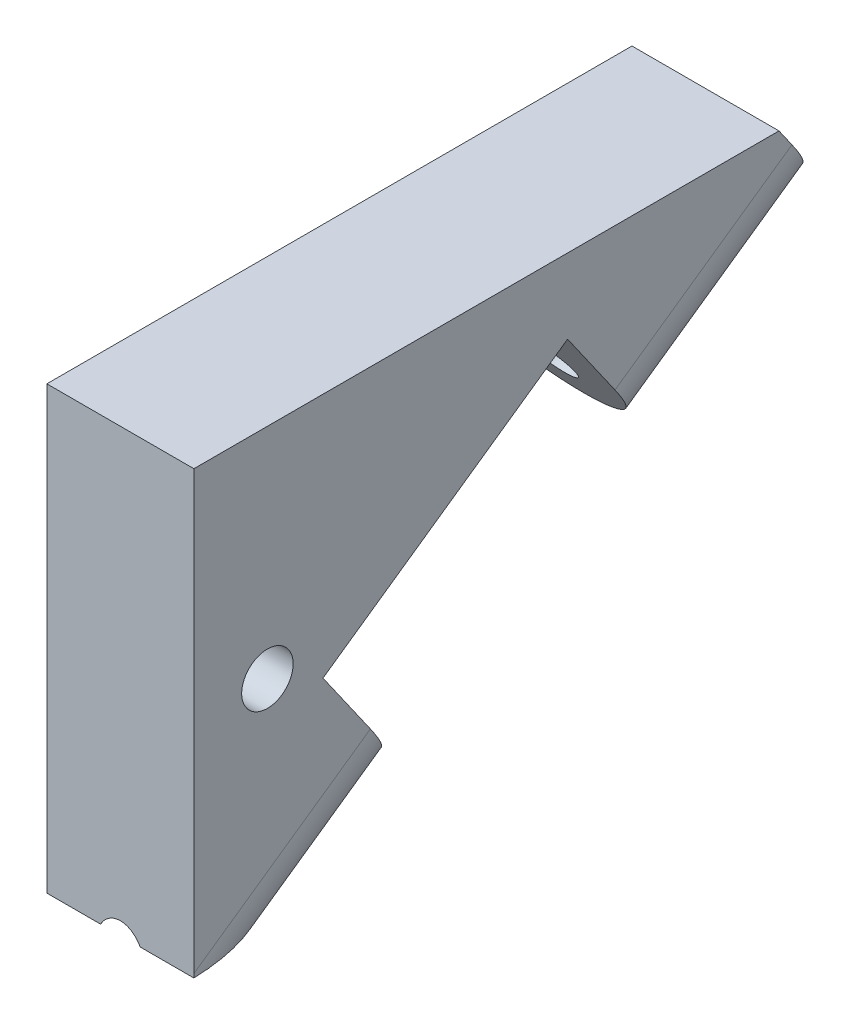
ISO-10303-21;
HEADER;
FILE_DESCRIPTION(('STEP AP214'),'2;1');
FILE_NAME('part.step','',(''),(''),'','','');
FILE_SCHEMA(('AUTOMOTIVE_DESIGN { 1 0 10303 214 1 1 1 1 }'));
ENDSEC;
DATA;
#1=APPLICATION_CONTEXT('core data for automotive mechanical design processes');
#2=APPLICATION_PROTOCOL_DEFINITION('international standard','automotive_design',2000,#1);
#3=PRODUCT_CONTEXT('',#1,'mechanical');
#4=PRODUCT('Part','Part','',(#3));
#5=PRODUCT_RELATED_PRODUCT_CATEGORY('part','',(#4));
#6=PRODUCT_DEFINITION_FORMATION('','',#4);
#7=PRODUCT_DEFINITION_CONTEXT('part definition',#1,'design');
#8=PRODUCT_DEFINITION('design','',#6,#7);
#9=PRODUCT_DEFINITION_SHAPE('','',#8);
#10=(LENGTH_UNIT() NAMED_UNIT(*) SI_UNIT(.MILLI.,.METRE.));
#11=(NAMED_UNIT(*) PLANE_ANGLE_UNIT() SI_UNIT($,.RADIAN.));
#12=(NAMED_UNIT(*) SI_UNIT($,.STERADIAN.) SOLID_ANGLE_UNIT());
#13=UNCERTAINTY_MEASURE_WITH_UNIT(LENGTH_MEASURE(1.E-05),#10,'distance_accuracy_value','');
#14=(GEOMETRIC_REPRESENTATION_CONTEXT(3) GLOBAL_UNCERTAINTY_ASSIGNED_CONTEXT((#13)) GLOBAL_UNIT_ASSIGNED_CONTEXT((#10,
#11,#12)) REPRESENTATION_CONTEXT('',''));
#15=CARTESIAN_POINT('',(0.,0.,0.));
#16=DIRECTION('',(0.,0.,1.));
#17=DIRECTION('',(1.,0.,0.));
#18=AXIS2_PLACEMENT_3D('',#15,#16,#17);
#19=CARTESIAN_POINT('',(-2.,3.,0.));
#20=DIRECTION('',(1.,0.,0.));
#21=DIRECTION('',(0.,0.,1.));
#22=AXIS2_PLACEMENT_3D('',#19,#20,#21);
#23=PLANE('',#22);
#24=CARTESIAN_POINT('',(-2.,1.55251147594245,-11.));
#25=DIRECTION('',(1.,0.,0.));
#26=DIRECTION('',(0.,0.,-1.));
#27=AXIS2_PLACEMENT_3D('',#24,#25,#26);
#28=CIRCLE('',#27,0.7);
#29=CARTESIAN_POINT('',(-2.,1.55251147594245,-11.7));
#30=VERTEX_POINT('',#29);
#31=EDGE_CURVE('E142',#30,#30,#28,.T.);
#32=ORIENTED_EDGE('',*,*,#31,.T.);
#33=EDGE_LOOP('',(#32));
#34=FACE_BOUND('',#33,.T.);
#35=DIRECTION('',(0.,1.,0.));
#36=VECTOR('',#35,1.);
#37=CARTESIAN_POINT('',(-2.,-4.5,-9.));
#38=LINE('',#37,#36);
#39=CARTESIAN_POINT('',(-2.,-4.3949770481151,-9.));
#40=VERTEX_POINT('',#39);
#41=CARTESIAN_POINT('',(-2.,7.5,-9.));
#42=VERTEX_POINT('',#41);
#43=EDGE_CURVE('E237',#40,#42,#38,.T.);
#44=ORIENTED_EDGE('',*,*,#43,.T.);
#45=DIRECTION('',(0.,0.,-1.));
#46=VECTOR('',#45,1.);
#47=CARTESIAN_POINT('',(-2.,7.5,-26.1377760809054));
#48=LINE('',#47,#46);
#49=CARTESIAN_POINT('',(-2.,7.5,-24.9170014921439));
#50=VERTEX_POINT('',#49);
#51=EDGE_CURVE('E235',#42,#50,#48,.T.);
#52=ORIENTED_EDGE('',*,*,#51,.T.);
#53=DIRECTION('',(0.,-0.819152044288991,-0.573576436351047));
#54=VECTOR('',#53,1.);
#55=CARTESIAN_POINT('',(-2.,16.1876158946568,-18.8338673536347));
#56=LINE('',#55,#54);
#57=CARTESIAN_POINT('',(-2.,6.99689502211948,-25.2692793901667));
#58=VERTEX_POINT('',#57);
#59=EDGE_CURVE('E233',#50,#58,#56,.T.);
#60=ORIENTED_EDGE('',*,*,#59,.T.);
#61=DIRECTION('',(0.,-0.573576436351046,0.819152044288992));
#62=VECTOR('',#61,1.);
#63=CARTESIAN_POINT('',(-2.,3.39689502211948,-20.1279465658951));
#64=LINE('',#63,#62);
#65=CARTESIAN_POINT('',(-2.,3.62632559665989,-20.4556073836107));
#66=VERTEX_POINT('',#65);
#67=EDGE_CURVE('E231',#58,#66,#64,.T.);
#68=ORIENTED_EDGE('',*,*,#67,.T.);
#69=DIRECTION('',(0.,0.819152044288992,0.573576436351046));
#70=VECTOR('',#69,1.);
#71=CARTESIAN_POINT('',(-2.,3.62632559665989,-20.4556073836107));
#72=LINE('',#71,#70);
#73=CARTESIAN_POINT('',(-2.,5.46941769631014,-19.1650604018208));
#74=VERTEX_POINT('',#73);
#75=EDGE_CURVE('E138',#66,#74,#72,.T.);
#76=ORIENTED_EDGE('',*,*,#75,.T.);
#77=DIRECTION('',(0.,0.573576436351049,-0.81915204428899));
#78=VECTOR('',#77,1.);
#79=CARTESIAN_POINT('',(-2.,0.810556547229282,-12.5115171380727));
#80=LINE('',#79,#78);
#81=CARTESIAN_POINT('',(-2.,0.810556547229282,-12.5115171380727));
#82=VERTEX_POINT('',#81);
#83=EDGE_CURVE('E134',#82,#74,#80,.T.);
#84=ORIENTED_EDGE('',*,*,#83,.F.);
#85=DIRECTION('',(0.,0.819152044288992,0.573576436351046));
#86=VECTOR('',#85,1.);
#87=CARTESIAN_POINT('',(-2.,-1.03253555242094,-13.8020641198626));
#88=LINE('',#87,#86);
#89=CARTESIAN_POINT('',(-2.,-1.03253555242094,-13.8020641198626));
#90=VERTEX_POINT('',#89);
#91=EDGE_CURVE('E136',#90,#82,#88,.T.);
#92=ORIENTED_EDGE('',*,*,#91,.F.);
#93=DIRECTION('',(0.,-0.573576436351046,0.819152044288992));
#94=VECTOR('',#93,1.);
#95=CARTESIAN_POINT('',(-2.,-2.86169591142201,-11.1897523991435));
#96=LINE('',#95,#94);
#97=EDGE_CURVE('E152',#90,#40,#96,.T.);
#98=ORIENTED_EDGE('',*,*,#97,.T.);
#99=EDGE_LOOP('',(#44,#52,#60,#68,#76,#84,#92,#98));
#100=FACE_BOUND('',#99,.T.);
#101=ADVANCED_FACE('F37',(#34,#100),#23,.F.);
#102=CARTESIAN_POINT('',(2.,3.,0.));
#103=DIRECTION('',(1.,0.,0.));
#104=DIRECTION('',(0.,0.,1.));
#105=AXIS2_PLACEMENT_3D('',#102,#103,#104);
#106=PLANE('',#105);
#107=CARTESIAN_POINT('',(2.,1.55251147594245,-11.));
#108=DIRECTION('',(1.,0.,0.));
#109=DIRECTION('',(0.,0.,-1.));
#110=AXIS2_PLACEMENT_3D('',#107,#108,#109);
#111=CIRCLE('',#110,0.7);
#112=CARTESIAN_POINT('',(2.,1.55251147594245,-11.7));
#113=VERTEX_POINT('',#112);
#114=EDGE_CURVE('E242',#113,#113,#111,.T.);
#115=ORIENTED_EDGE('',*,*,#114,.F.);
#116=EDGE_LOOP('',(#115));
#117=FACE_BOUND('',#116,.T.);
#118=DIRECTION('',(0.,-1.,0.));
#119=VECTOR('',#118,1.);
#120=CARTESIAN_POINT('',(2.,-4.5,-9.));
#121=LINE('',#120,#119);
#122=CARTESIAN_POINT('',(2.,7.5,-9.));
#123=VERTEX_POINT('',#122);
#124=CARTESIAN_POINT('',(2.,-4.3949770481151,-9.));
#125=VERTEX_POINT('',#124);
#126=EDGE_CURVE('E216',#123,#125,#121,.T.);
#127=ORIENTED_EDGE('',*,*,#126,.T.);
#128=DIRECTION('',(0.,-0.573576436351046,0.819152044288992));
#129=VECTOR('',#128,1.);
#130=CARTESIAN_POINT('',(2.,-6.19072087253732,-6.43541203653195));
#131=LINE('',#130,#129);
#132=CARTESIAN_POINT('',(2.,-1.03253555242094,-13.8020641198626));
#133=VERTEX_POINT('',#132);
#134=EDGE_CURVE('E213',#125,#133,#131,.F.);
#135=ORIENTED_EDGE('',*,*,#134,.T.);
#136=DIRECTION('',(0.,-0.819152044288992,-0.573576436351046));
#137=VECTOR('',#136,1.);
#138=CARTESIAN_POINT('',(2.,0.237150116226979,-12.9130206435185));
#139=LINE('',#138,#137);
#140=CARTESIAN_POINT('',(2.,0.810556547229282,-12.5115171380727));
#141=VERTEX_POINT('',#140);
#142=EDGE_CURVE('E228',#141,#133,#139,.T.);
#143=ORIENTED_EDGE('',*,*,#142,.F.);
#144=DIRECTION('',(0.,-0.573576436351049,0.81915204428899));
#145=VECTOR('',#144,1.);
#146=CARTESIAN_POINT('',(2.,5.46941769631014,-19.1650604018208));
#147=LINE('',#146,#145);
#148=CARTESIAN_POINT('',(2.,5.46941769631014,-19.1650604018208));
#149=VERTEX_POINT('',#148);
#150=EDGE_CURVE('E155',#149,#141,#147,.T.);
#151=ORIENTED_EDGE('',*,*,#150,.F.);
#152=DIRECTION('',(0.,-0.819152044288992,-0.573576436351046));
#153=VECTOR('',#152,1.);
#154=CARTESIAN_POINT('',(2.,4.89601126530782,-19.5665639072665));
#155=LINE('',#154,#153);
#156=CARTESIAN_POINT('',(2.,3.62632559665989,-20.4556073836107));
#157=VERTEX_POINT('',#156);
#158=EDGE_CURVE('E225',#149,#157,#155,.T.);
#159=ORIENTED_EDGE('',*,*,#158,.T.);
#160=DIRECTION('',(0.,-0.573576436351046,0.819152044288992));
#161=VECTOR('',#160,1.);
#162=CARTESIAN_POINT('',(2.,-6.19072087253732,-6.43541203653195));
#163=LINE('',#162,#161);
#164=CARTESIAN_POINT('',(2.,6.99689502211948,-25.2692793901667));
#165=VERTEX_POINT('',#164);
#166=EDGE_CURVE('E223',#157,#165,#163,.F.);
#167=ORIENTED_EDGE('',*,*,#166,.T.);
#168=DIRECTION('',(0.,-0.819152044288991,-0.573576436351047));
#169=VECTOR('',#168,1.);
#170=CARTESIAN_POINT('',(2.,16.1876158946568,-18.8338673536347));
#171=LINE('',#170,#169);
#172=CARTESIAN_POINT('',(2.,7.5,-24.9170014921439));
#173=VERTEX_POINT('',#172);
#174=EDGE_CURVE('E220',#173,#165,#171,.T.);
#175=ORIENTED_EDGE('',*,*,#174,.F.);
#176=DIRECTION('',(0.,0.,1.));
#177=VECTOR('',#176,1.);
#178=CARTESIAN_POINT('',(2.,7.5,-26.1377760809054));
#179=LINE('',#178,#177);
#180=EDGE_CURVE('E218',#173,#123,#179,.T.);
#181=ORIENTED_EDGE('',*,*,#180,.T.);
#182=EDGE_LOOP('',(#127,#135,#143,#151,#159,#167,#175,#181));
#183=FACE_BOUND('',#182,.T.);
#184=ADVANCED_FACE('F249',(#117,#183),#106,.T.);
#185=CARTESIAN_POINT('',(0.,-12.3156879277468,1.52739639669704));
#186=DIRECTION('',(0.,0.573576436351047,-0.819152044288991));
#187=DIRECTION('',(0.,0.819152044288991,0.573576436351047));
#188=AXIS2_PLACEMENT_3D('',#185,#186,#187);
#189=CYLINDRICAL_SURFACE('',#188,0.649999999999999);
#190=CARTESIAN_POINT('',(0.,-4.5,-9.63456273863293));
#191=DIRECTION('',(0.,1.,0.));
#192=DIRECTION('',(0.,0.,-1.));
#193=AXIS2_PLACEMENT_3D('',#190,#191,#192);
#194=ELLIPSE('',#193,1.13324041715371,0.649999999999999);
#195=CARTESIAN_POINT('',(0.538540312853344,-4.5,-9.));
#196=VERTEX_POINT('',#195);
#197=CARTESIAN_POINT('',(-0.538540312853344,-4.5,-9.));
#198=VERTEX_POINT('',#197);
#199=EDGE_CURVE('E211',#196,#198,#194,.T.);
#200=ORIENTED_EDGE('',*,*,#199,.F.);
#201=CARTESIAN_POINT('',(0.,-4.94432561305778,-9.));
#202=DIRECTION('',(0.,0.,-1.));
#203=DIRECTION('',(0.,1.,0.));
#204=AXIS2_PLACEMENT_3D('',#201,#202,#203);
#205=ELLIPSE('',#204,0.793503482694946,0.649999999999999);
#206=EDGE_CURVE('E208',#198,#196,#205,.T.);
#207=ORIENTED_EDGE('',*,*,#206,.F.);
#208=EDGE_LOOP('',(#200,#207));
#209=FACE_BOUND('',#208,.T.);
#210=CARTESIAN_POINT('',(0.,-1.40115397235099,-14.0601735162206));
#211=DIRECTION('',(0.,0.573576436351046,-0.819152044288991));
#212=DIRECTION('',(0.,0.819152044288991,0.573576436351046));
#213=AXIS2_PLACEMENT_3D('',#210,#211,#212);
#214=CIRCLE('',#213,0.649999999999999);
#215=CARTESIAN_POINT('',(0.,-0.868705143563148,-13.6873488325924));
#216=VERTEX_POINT('',#215);
#217=EDGE_CURVE('E205',#216,#216,#214,.F.);
#218=ORIENTED_EDGE('',*,*,#217,.F.);
#219=EDGE_LOOP('',(#218));
#220=FACE_BOUND('',#219,.T.);
#221=ADVANCED_FACE('F252',(#209,#220),#189,.F.);
#222=CARTESIAN_POINT('',(0.,7.57047145847052,-26.0884314344557));
#223=DIRECTION('',(0.,-0.573576436351046,0.819152044288992));
#224=DIRECTION('',(0.,-0.819152044288992,-0.573576436351046));
#225=AXIS2_PLACEMENT_3D('',#222,#223,#224);
#226=CYLINDRICAL_SURFACE('',#225,2.);
#227=DIRECTION('',(0.,-0.573576436351046,0.819152044288992));
#228=VECTOR('',#227,1.);
#229=CARTESIAN_POINT('',(0.,5.93216736989254,-27.2355843071578));
#230=LINE('',#229,#228);
#231=CARTESIAN_POINT('',(0.,-2.67083964099893,-14.9492169925647));
#232=VERTEX_POINT('',#231);
#233=CARTESIAN_POINT('',(0.,-4.5,-12.3369052718456));
#234=VERTEX_POINT('',#233);
#235=EDGE_CURVE('E203',#232,#234,#230,.T.);
#236=ORIENTED_EDGE('',*,*,#235,.F.);
#237=CARTESIAN_POINT('',(0.,-1.03253555242094,-13.8020641198626));
#238=DIRECTION('',(0.,0.573576436351046,-0.819152044288991));
#239=DIRECTION('',(0.,0.819152044288991,0.573576436351046));
#240=AXIS2_PLACEMENT_3D('',#237,#238,#239);
#241=CIRCLE('',#240,2.);
#242=EDGE_CURVE('E201',#133,#232,#241,.T.);
#243=ORIENTED_EDGE('',*,*,#242,.F.);
#244=ORIENTED_EDGE('',*,*,#134,.F.);
#245=CARTESIAN_POINT('',(0.,-4.3949770481151,-9.));
#246=DIRECTION('',(0.,0.,-1.));
#247=DIRECTION('',(0.,-1.,0.));
#248=AXIS2_PLACEMENT_3D('',#245,#246,#247);
#249=ELLIPSE('',#248,2.44154917752291,2.);
#250=CARTESIAN_POINT('',(1.99814886317506,-4.5,-9.));
#251=VERTEX_POINT('',#250);
#252=EDGE_CURVE('E198',#251,#125,#249,.F.);
#253=ORIENTED_EDGE('',*,*,#252,.F.);
#254=CARTESIAN_POINT('',(0.,-4.5,-8.85001168060342));
#255=DIRECTION('',(0.,1.,0.));
#256=DIRECTION('',(0.,0.,1.));
#257=AXIS2_PLACEMENT_3D('',#254,#255,#256);
#258=ELLIPSE('',#257,3.4868935912422,2.);
#259=EDGE_CURVE('E195',#234,#251,#258,.F.);
#260=ORIENTED_EDGE('',*,*,#259,.F.);
#261=EDGE_LOOP('',(#236,#243,#244,#253,#260));
#262=FACE_BOUND('',#261,.T.);
#263=ADVANCED_FACE('F261',(#262),#226,.T.);
#264=CARTESIAN_POINT('',(0.,-6.19072087253732,-6.43541203653195));
#265=DIRECTION('',(0.,0.573576436351046,-0.819152044288992));
#266=DIRECTION('',(0.,0.819152044288992,0.573576436351046));
#267=AXIS2_PLACEMENT_3D('',#264,#265,#266);
#268=CYLINDRICAL_SURFACE('',#267,2.);
#269=ORIENTED_EDGE('',*,*,#97,.F.);
#270=CARTESIAN_POINT('',(0.,-1.03253555242094,-13.8020641198626));
#271=DIRECTION('',(0.,0.573576436351046,-0.819152044288991));
#272=DIRECTION('',(0.,0.819152044288991,0.573576436351046));
#273=AXIS2_PLACEMENT_3D('',#270,#271,#272);
#274=CIRCLE('',#273,2.);
#275=EDGE_CURVE('E151',#90,#232,#274,.F.);
#276=ORIENTED_EDGE('',*,*,#275,.T.);
#277=ORIENTED_EDGE('',*,*,#235,.T.);
#278=CARTESIAN_POINT('',(0.,-4.5,-8.85001168060342));
#279=DIRECTION('',(0.,1.,0.));
#280=DIRECTION('',(0.,0.,-1.));
#281=AXIS2_PLACEMENT_3D('',#278,#279,#280);
#282=ELLIPSE('',#281,3.4868935912422,2.);
#283=CARTESIAN_POINT('',(-1.99814886317506,-4.5,-9.));
#284=VERTEX_POINT('',#283);
#285=EDGE_CURVE('E191',#284,#234,#282,.F.);
#286=ORIENTED_EDGE('',*,*,#285,.F.);
#287=CARTESIAN_POINT('',(0.,-4.3949770481151,-9.));
#288=DIRECTION('',(0.,0.,-1.));
#289=DIRECTION('',(0.,1.,0.));
#290=AXIS2_PLACEMENT_3D('',#287,#288,#289);
#291=ELLIPSE('',#290,2.44154917752291,2.);
#292=EDGE_CURVE('E188',#40,#284,#291,.F.);
#293=ORIENTED_EDGE('',*,*,#292,.F.);
#294=EDGE_LOOP('',(#269,#276,#277,#286,#293));
#295=FACE_BOUND('',#294,.T.);
#296=ADVANCED_FACE('F271',(#295),#268,.T.);
#297=CARTESIAN_POINT('',(22.9213615474532,-4.5,-26.1377760809054));
#298=DIRECTION('',(0.,0.,1.));
#299=DIRECTION('',(0.,-1.,0.));
#300=AXIS2_PLACEMENT_3D('',#297,#298,#299);
#301=PLANE('',#300);
#302=DIRECTION('',(1.,0.,0.));
#303=VECTOR('',#302,1.);
#304=CARTESIAN_POINT('',(22.9213615474532,5.75655320437892,-26.1377760809054));
#305=LINE('',#304,#303);
#306=CARTESIAN_POINT('',(-1.30662376885621,5.75655320437892,-26.1377760809054));
#307=VERTEX_POINT('',#306);
#308=CARTESIAN_POINT('',(1.30662376885621,5.75655320437892,-26.1377760809054));
#309=VERTEX_POINT('',#308);
#310=EDGE_CURVE('E60',#307,#309,#305,.T.);
#311=ORIENTED_EDGE('',*,*,#310,.T.);
#312=CARTESIAN_POINT('',(0.,7.60502295188489,-26.1377760809054));
#313=DIRECTION('',(0.,0.,1.));
#314=DIRECTION('',(0.,-1.,0.));
#315=AXIS2_PLACEMENT_3D('',#312,#313,#314);
#316=ELLIPSE('',#315,2.44154917752291,2.);
#317=CARTESIAN_POINT('',(0.,5.16347377436198,-26.1377760809054));
#318=VERTEX_POINT('',#317);
#319=EDGE_CURVE('E185',#309,#318,#316,.F.);
#320=ORIENTED_EDGE('',*,*,#319,.T.);
#321=CARTESIAN_POINT('',(0.,7.60502295188489,-26.1377760809054));
#322=DIRECTION('',(0.,0.,1.));
#323=DIRECTION('',(0.,1.,0.));
#324=AXIS2_PLACEMENT_3D('',#321,#322,#323);
#325=ELLIPSE('',#324,2.44154917752291,2.);
#326=EDGE_CURVE('E183',#318,#307,#325,.F.);
#327=ORIENTED_EDGE('',*,*,#326,.T.);
#328=EDGE_LOOP('',(#311,#320,#327));
#329=FACE_BOUND('',#328,.T.);
#330=ADVANCED_FACE('F294',(#329),#301,.F.);
#331=CARTESIAN_POINT('',(22.9213615474532,-4.5,-26.1377760809054));
#332=DIRECTION('',(0.,1.,0.));
#333=DIRECTION('',(0.,0.,1.));
#334=AXIS2_PLACEMENT_3D('',#331,#332,#333);
#335=PLANE('',#334);
#336=DIRECTION('',(-1.,0.,0.));
#337=VECTOR('',#336,1.);
#338=CARTESIAN_POINT('',(22.9213615474532,-4.5,-9.));
#339=LINE('',#338,#337);
#340=EDGE_CURVE('E180',#198,#284,#339,.T.);
#341=ORIENTED_EDGE('',*,*,#340,.T.);
#342=ORIENTED_EDGE('',*,*,#285,.T.);
#343=ORIENTED_EDGE('',*,*,#259,.T.);
#344=EDGE_CURVE('E179',#251,#196,#339,.T.);
#345=ORIENTED_EDGE('',*,*,#344,.T.);
#346=ORIENTED_EDGE('',*,*,#199,.T.);
#347=EDGE_LOOP('',(#341,#342,#343,#345,#346));
#348=FACE_BOUND('',#347,.T.);
#349=ADVANCED_FACE('F269',(#348),#335,.F.);
#350=CARTESIAN_POINT('',(0.,3.25770717672985,-20.7137167799686));
#351=DIRECTION('',(0.,0.573576436351046,-0.819152044288992));
#352=DIRECTION('',(0.,0.819152044288992,0.573576436351046));
#353=AXIS2_PLACEMENT_3D('',#350,#351,#352);
#354=CIRCLE('',#353,0.649999999999999);
#355=CARTESIAN_POINT('',(0.,3.7901560055177,-20.3408920963405));
#356=VERTEX_POINT('',#355);
#357=EDGE_CURVE('E176',#356,#356,#354,.F.);
#358=ORIENTED_EDGE('',*,*,#357,.T.);
#359=EDGE_LOOP('',(#358));
#360=FACE_BOUND('',#359,.T.);
#361=CARTESIAN_POINT('',(0.,6.62827660218946,-25.5273887865247));
#362=DIRECTION('',(0.,0.573576436351047,-0.819152044288991));
#363=DIRECTION('',(0.,0.819152044288991,0.573576436351047));
#364=AXIS2_PLACEMENT_3D('',#361,#362,#363);
#365=CIRCLE('',#364,0.649999999999999);
#366=CARTESIAN_POINT('',(0.,7.1607254309773,-25.1545641028965));
#367=VERTEX_POINT('',#366);
#368=EDGE_CURVE('E173',#367,#367,#365,.T.);
#369=ORIENTED_EDGE('',*,*,#368,.T.);
#370=EDGE_LOOP('',(#369));
#371=FACE_BOUND('',#370,.T.);
#372=ADVANCED_FACE('F301',(#360,#371),#189,.F.);
#373=CARTESIAN_POINT('',(22.9213615474532,-4.5,-9.));
#374=DIRECTION('',(0.,0.,-1.));
#375=DIRECTION('',(1.,0.,0.));
#376=AXIS2_PLACEMENT_3D('',#373,#374,#375);
#377=PLANE('',#376);
#378=DIRECTION('',(-1.,0.,0.));
#379=VECTOR('',#378,1.);
#380=CARTESIAN_POINT('',(22.9213615474532,7.5,-9.));
#381=LINE('',#380,#379);
#382=EDGE_CURVE('E170',#123,#42,#381,.T.);
#383=ORIENTED_EDGE('',*,*,#382,.T.);
#384=ORIENTED_EDGE('',*,*,#43,.F.);
#385=ORIENTED_EDGE('',*,*,#292,.T.);
#386=ORIENTED_EDGE('',*,*,#340,.F.);
#387=ORIENTED_EDGE('',*,*,#206,.T.);
#388=ORIENTED_EDGE('',*,*,#344,.F.);
#389=ORIENTED_EDGE('',*,*,#252,.T.);
#390=ORIENTED_EDGE('',*,*,#126,.F.);
#391=EDGE_LOOP('',(#383,#384,#385,#386,#387,#388,#389,#390));
#392=FACE_BOUND('',#391,.T.);
#393=ADVANCED_FACE('F264',(#392),#377,.F.);
#394=CARTESIAN_POINT('',(22.9213615474532,7.5,-26.1377760809054));
#395=DIRECTION('',(0.,-1.,0.));
#396=DIRECTION('',(0.,0.,-1.));
#397=AXIS2_PLACEMENT_3D('',#394,#395,#396);
#398=PLANE('',#397);
#399=ORIENTED_EDGE('',*,*,#180,.F.);
#400=DIRECTION('',(-1.,0.,0.));
#401=VECTOR('',#400,1.);
#402=CARTESIAN_POINT('',(22.9213615474532,7.5,-24.9170014921439));
#403=LINE('',#402,#401);
#404=EDGE_CURVE('E167',#173,#50,#403,.T.);
#405=ORIENTED_EDGE('',*,*,#404,.T.);
#406=ORIENTED_EDGE('',*,*,#51,.F.);
#407=ORIENTED_EDGE('',*,*,#382,.F.);
#408=EDGE_LOOP('',(#399,#405,#406,#407));
#409=FACE_BOUND('',#408,.T.);
#410=ADVANCED_FACE('F276',(#409),#398,.F.);
#411=CARTESIAN_POINT('',(0.,16.1876158946568,-18.8338673536347));
#412=DIRECTION('',(0.,-0.573576436351047,0.819152044288991));
#413=DIRECTION('',(0.,-0.819152044288991,-0.573576436351047));
#414=AXIS2_PLACEMENT_3D('',#411,#412,#413);
#415=PLANE('',#414);
#416=ORIENTED_EDGE('',*,*,#368,.F.);
#417=EDGE_LOOP('',(#416));
#418=FACE_BOUND('',#417,.T.);
#419=ORIENTED_EDGE('',*,*,#174,.T.);
#420=CARTESIAN_POINT('',(0.,6.99689502211948,-25.2692793901667));
#421=DIRECTION('',(0.,-0.573576436351047,0.819152044288991));
#422=DIRECTION('',(0.,-0.819152044288991,-0.573576436351047));
#423=AXIS2_PLACEMENT_3D('',#420,#421,#422);
#424=CIRCLE('',#423,2.);
#425=EDGE_CURVE('E165',#165,#309,#424,.F.);
#426=ORIENTED_EDGE('',*,*,#425,.T.);
#427=ORIENTED_EDGE('',*,*,#310,.F.);
#428=CARTESIAN_POINT('',(0.,6.99689502211948,-25.2692793901667));
#429=DIRECTION('',(0.,-0.573576436351047,0.819152044288991));
#430=DIRECTION('',(0.,-0.819152044288991,-0.573576436351047));
#431=AXIS2_PLACEMENT_3D('',#428,#429,#430);
#432=CIRCLE('',#431,2.);
#433=EDGE_CURVE('E163',#307,#58,#432,.F.);
#434=ORIENTED_EDGE('',*,*,#433,.T.);
#435=ORIENTED_EDGE('',*,*,#59,.F.);
#436=ORIENTED_EDGE('',*,*,#404,.F.);
#437=EDGE_LOOP('',(#419,#426,#427,#434,#435,#436));
#438=FACE_BOUND('',#437,.T.);
#439=ADVANCED_FACE('F280',(#418,#438),#415,.F.);
#440=CARTESIAN_POINT('',(0.,-6.19072087253732,-6.43541203653195));
#441=DIRECTION('',(0.,0.573576436351046,-0.819152044288992));
#442=DIRECTION('',(0.,0.819152044288992,0.573576436351046));
#443=AXIS2_PLACEMENT_3D('',#440,#441,#442);
#444=CYLINDRICAL_SURFACE('',#443,2.);
#445=CARTESIAN_POINT('',(0.,3.62632559665989,-20.4556073836107));
#446=DIRECTION('',(0.,0.573576436351046,-0.819152044288992));
#447=DIRECTION('',(0.,0.819152044288992,0.573576436351046));
#448=AXIS2_PLACEMENT_3D('',#445,#446,#447);
#449=CIRCLE('',#448,2.);
#450=CARTESIAN_POINT('',(0.,1.9880215080819,-21.6027602563128));
#451=VERTEX_POINT('',#450);
#452=EDGE_CURVE('E52',#451,#66,#449,.T.);
#453=ORIENTED_EDGE('',*,*,#452,.T.);
#454=ORIENTED_EDGE('',*,*,#67,.F.);
#455=ORIENTED_EDGE('',*,*,#433,.F.);
#456=ORIENTED_EDGE('',*,*,#326,.F.);
#457=DIRECTION('',(0.,-0.573576436351046,0.819152044288992));
#458=VECTOR('',#457,1.);
#459=CARTESIAN_POINT('',(0.,5.16347377436198,-26.1377760809054));
#460=LINE('',#459,#458);
#461=EDGE_CURVE('E158',#451,#318,#460,.F.);
#462=ORIENTED_EDGE('',*,*,#461,.F.);
#463=EDGE_LOOP('',(#453,#454,#455,#456,#462));
#464=FACE_BOUND('',#463,.T.);
#465=ADVANCED_FACE('F284',(#464),#444,.T.);
#466=CARTESIAN_POINT('',(0.,7.57047145847052,-26.0884314344557));
#467=DIRECTION('',(0.,-0.573576436351046,0.819152044288992));
#468=DIRECTION('',(0.,-0.819152044288992,-0.573576436351046));
#469=AXIS2_PLACEMENT_3D('',#466,#467,#468);
#470=CYLINDRICAL_SURFACE('',#469,2.);
#471=EDGE_CURVE('E156',#157,#451,#449,.T.);
#472=ORIENTED_EDGE('',*,*,#471,.T.);
#473=ORIENTED_EDGE('',*,*,#461,.T.);
#474=ORIENTED_EDGE('',*,*,#319,.F.);
#475=ORIENTED_EDGE('',*,*,#425,.F.);
#476=ORIENTED_EDGE('',*,*,#166,.F.);
#477=EDGE_LOOP('',(#472,#473,#474,#475,#476));
#478=FACE_BOUND('',#477,.T.);
#479=ADVANCED_FACE('F291',(#478),#470,.T.);
#480=CARTESIAN_POINT('',(0.,-1.03253555242094,-13.8020641198626));
#481=DIRECTION('',(0.,0.573576436351046,-0.819152044288991));
#482=DIRECTION('',(0.,0.819152044288991,0.573576436351046));
#483=AXIS2_PLACEMENT_3D('',#480,#481,#482);
#484=PLANE('',#483);
#485=ORIENTED_EDGE('',*,*,#242,.T.);
#486=ORIENTED_EDGE('',*,*,#275,.F.);
#487=ORIENTED_EDGE('',*,*,#91,.T.);
#488=DIRECTION('',(-1.,0.,0.));
#489=VECTOR('',#488,1.);
#490=CARTESIAN_POINT('',(2.,0.810556547229282,-12.5115171380727));
#491=LINE('',#490,#489);
#492=EDGE_CURVE('E45',#141,#82,#491,.T.);
#493=ORIENTED_EDGE('',*,*,#492,.F.);
#494=ORIENTED_EDGE('',*,*,#142,.T.);
#495=EDGE_LOOP('',(#485,#486,#487,#493,#494));
#496=FACE_BOUND('',#495,.T.);
#497=ORIENTED_EDGE('',*,*,#217,.T.);
#498=EDGE_LOOP('',(#497));
#499=FACE_BOUND('',#498,.T.);
#500=ADVANCED_FACE('F148',(#496,#499),#484,.T.);
#501=CARTESIAN_POINT('',(0.,3.62632559665989,-20.4556073836107));
#502=DIRECTION('',(0.,0.573576436351046,-0.819152044288992));
#503=DIRECTION('',(0.,0.819152044288992,0.573576436351046));
#504=AXIS2_PLACEMENT_3D('',#501,#502,#503);
#505=PLANE('',#504);
#506=ORIENTED_EDGE('',*,*,#471,.F.);
#507=ORIENTED_EDGE('',*,*,#158,.F.);
#508=DIRECTION('',(1.,0.,0.));
#509=VECTOR('',#508,1.);
#510=CARTESIAN_POINT('',(-2.,5.46941769631014,-19.1650604018208));
#511=LINE('',#510,#509);
#512=EDGE_CURVE('E12',#74,#149,#511,.T.);
#513=ORIENTED_EDGE('',*,*,#512,.F.);
#514=ORIENTED_EDGE('',*,*,#75,.F.);
#515=ORIENTED_EDGE('',*,*,#452,.F.);
#516=EDGE_LOOP('',(#506,#507,#513,#514,#515));
#517=FACE_BOUND('',#516,.T.);
#518=ORIENTED_EDGE('',*,*,#357,.F.);
#519=EDGE_LOOP('',(#518));
#520=FACE_BOUND('',#519,.T.);
#521=ADVANCED_FACE('F285',(#517,#520),#505,.F.);
#522=CARTESIAN_POINT('',(0.,-4.3476287728871,-5.14486505474214));
#523=DIRECTION('',(0.,-0.81915204428899,-0.573576436351049));
#524=DIRECTION('',(0.,0.573576436351049,-0.81915204428899));
#525=AXIS2_PLACEMENT_3D('',#522,#523,#524);
#526=PLANE('',#525);
#527=ORIENTED_EDGE('',*,*,#83,.T.);
#528=ORIENTED_EDGE('',*,*,#512,.T.);
#529=ORIENTED_EDGE('',*,*,#150,.T.);
#530=ORIENTED_EDGE('',*,*,#492,.T.);
#531=EDGE_LOOP('',(#527,#528,#529,#530));
#532=FACE_BOUND('',#531,.T.);
#533=ADVANCED_FACE('F39',(#532),#526,.T.);
#534=CARTESIAN_POINT('',(-8.,1.55251147594245,-11.));
#535=DIRECTION('',(1.,0.,0.));
#536=DIRECTION('',(0.,0.,-1.));
#537=AXIS2_PLACEMENT_3D('',#534,#535,#536);
#538=CYLINDRICAL_SURFACE('',#537,0.7);
#539=ORIENTED_EDGE('',*,*,#114,.T.);
#540=EDGE_LOOP('',(#539));
#541=FACE_BOUND('',#540,.T.);
#542=ORIENTED_EDGE('',*,*,#31,.F.);
#543=EDGE_LOOP('',(#542));
#544=FACE_BOUND('',#543,.T.);
#545=ADVANCED_FACE('F246',(#541,#544),#538,.F.);
#546=CLOSED_SHELL('',(#101,#184,#221,#263,#296,#330,#349,#372,#393,#410,#439,#465,#479,#500,
#521,#533,#545));
#547=MANIFOLD_SOLID_BREP('B2',#546);
#548=ADVANCED_BREP_SHAPE_REPRESENTATION('',(#18,#547),#14);
#549=SHAPE_DEFINITION_REPRESENTATION(#9,#548);
ENDSEC;
END-ISO-10303-21;
